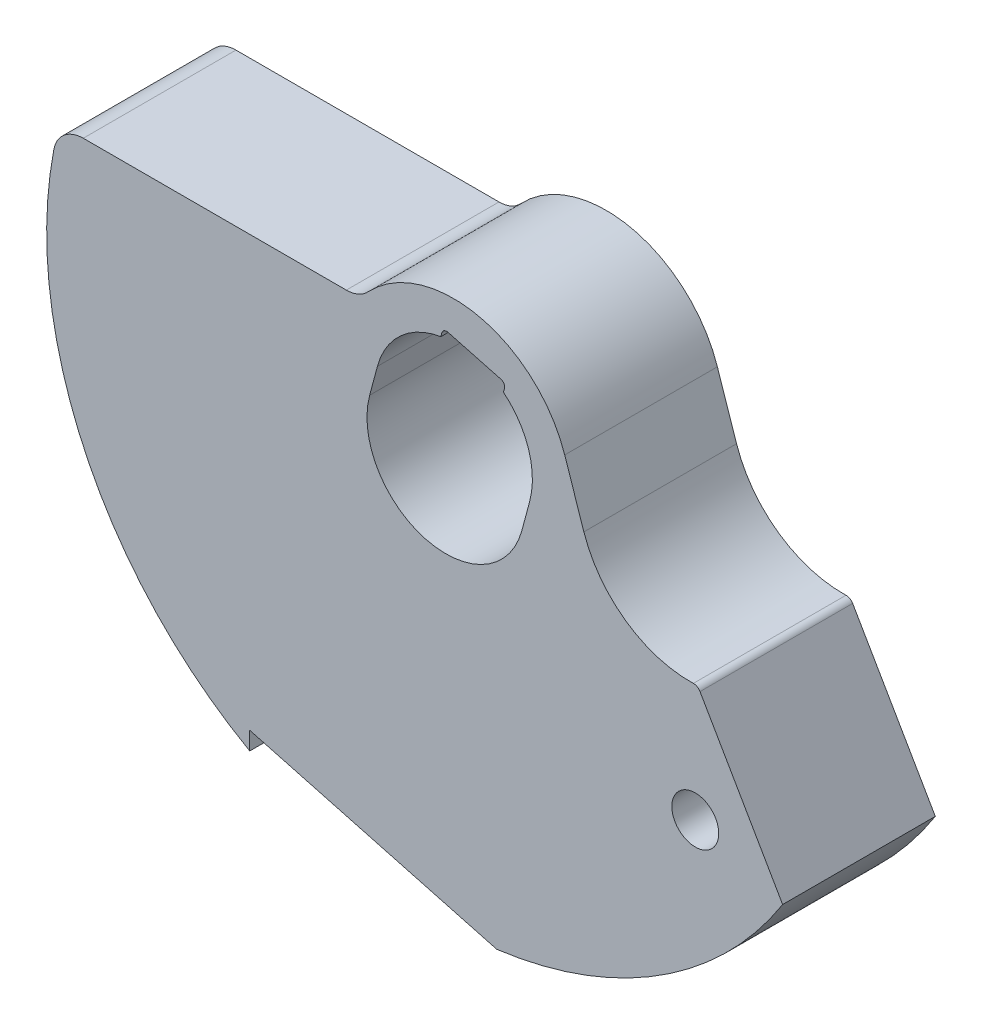
ISO-10303-21;
HEADER;
FILE_DESCRIPTION(('STEP AP214'),'2;1');
FILE_NAME('part.step','',(''),(''),'','','');
FILE_SCHEMA(('AUTOMOTIVE_DESIGN { 1 0 10303 214 1 1 1 1 }'));
ENDSEC;
DATA;
#1=APPLICATION_CONTEXT('core data for automotive mechanical design processes');
#2=APPLICATION_PROTOCOL_DEFINITION('international standard','automotive_design',2000,#1);
#3=PRODUCT_CONTEXT('',#1,'mechanical');
#4=PRODUCT('Part','Part','',(#3));
#5=PRODUCT_RELATED_PRODUCT_CATEGORY('part','',(#4));
#6=PRODUCT_DEFINITION_FORMATION('','',#4);
#7=PRODUCT_DEFINITION_CONTEXT('part definition',#1,'design');
#8=PRODUCT_DEFINITION('design','',#6,#7);
#9=PRODUCT_DEFINITION_SHAPE('','',#8);
#10=(LENGTH_UNIT() NAMED_UNIT(*) SI_UNIT(.MILLI.,.METRE.));
#11=(NAMED_UNIT(*) PLANE_ANGLE_UNIT() SI_UNIT($,.RADIAN.));
#12=(NAMED_UNIT(*) SI_UNIT($,.STERADIAN.) SOLID_ANGLE_UNIT());
#13=UNCERTAINTY_MEASURE_WITH_UNIT(LENGTH_MEASURE(1.E-05),#10,'distance_accuracy_value','');
#14=(GEOMETRIC_REPRESENTATION_CONTEXT(3) GLOBAL_UNCERTAINTY_ASSIGNED_CONTEXT((#13)) GLOBAL_UNIT_ASSIGNED_CONTEXT((#10,
#11,#12)) REPRESENTATION_CONTEXT('',''));
#15=CARTESIAN_POINT('',(0.,0.,0.));
#16=DIRECTION('',(0.,0.,1.));
#17=DIRECTION('',(1.,0.,0.));
#18=AXIS2_PLACEMENT_3D('',#15,#16,#17);
#19=CARTESIAN_POINT('',(-1.59474353920326,0.427310243464251,-7.7724));
#20=DIRECTION('',(0.96592582628907,-0.258819045102514,0.));
#21=DIRECTION('',(0.258819045102514,0.96592582628907,0.));
#22=AXIS2_PLACEMENT_3D('',#19,#20,#21);
#23=PLANE('',#22);
#24=DIRECTION('',(0.258819045102514,0.96592582628907,0.));
#25=VECTOR('',#24,1.);
#26=CARTESIAN_POINT('',(-1.59474353920326,0.427310243464251,0.));
#27=LINE('',#26,#25);
#28=CARTESIAN_POINT('',(-0.253578298371034,5.43260706359561,0.));
#29=VERTEX_POINT('',#28);
#30=CARTESIAN_POINT('',(-0.201054745135242,5.62862763286563,0.));
#31=VERTEX_POINT('',#30);
#32=EDGE_CURVE('E276',#29,#31,#27,.T.);
#33=ORIENTED_EDGE('',*,*,#32,.F.);
#34=DIRECTION('',(0.,0.,1.));
#35=VECTOR('',#34,1.);
#36=CARTESIAN_POINT('',(-0.253578298371034,5.43260706359561,-7.7724));
#37=LINE('',#36,#35);
#38=CARTESIAN_POINT('',(-0.253578298371034,5.43260706359561,-7.7724));
#39=VERTEX_POINT('',#38);
#40=EDGE_CURVE('E11',#39,#29,#37,.T.);
#41=ORIENTED_EDGE('',*,*,#40,.F.);
#42=DIRECTION('',(0.258819045102514,0.96592582628907,0.));
#43=VECTOR('',#42,1.);
#44=CARTESIAN_POINT('',(-1.59474353920326,0.427310243464251,-7.7724));
#45=LINE('',#44,#43);
#46=CARTESIAN_POINT('',(-0.201054745135242,5.62862763286563,-7.7724));
#47=VERTEX_POINT('',#46);
#48=EDGE_CURVE('E486',#39,#47,#45,.T.);
#49=ORIENTED_EDGE('',*,*,#48,.T.);
#50=DIRECTION('',(0.,0.,1.));
#51=VECTOR('',#50,1.);
#52=CARTESIAN_POINT('',(-0.201054745135242,5.62862763286563,-7.7724));
#53=LINE('',#52,#51);
#54=EDGE_CURVE('E333',#47,#31,#53,.T.);
#55=ORIENTED_EDGE('',*,*,#54,.T.);
#56=EDGE_LOOP('',(#33,#41,#49,#55));
#57=FACE_BOUND('',#56,.T.);
#58=ADVANCED_FACE('F41',(#57),#23,.T.);
#59=CARTESIAN_POINT('',(0.394440224736231,1.47207095926454,-7.7724));
#60=DIRECTION('',(0.,0.,1.));
#61=DIRECTION('',(1.,0.,0.));
#62=AXIS2_PLACEMENT_3D('',#59,#60,#61);
#63=CYLINDRICAL_SURFACE('',#62,4.0132);
#64=CARTESIAN_POINT('',(0.394440224736231,1.47207095926454,0.));
#65=DIRECTION('',(0.,0.,1.));
#66=DIRECTION('',(1.,0.,0.));
#67=AXIS2_PLACEMENT_3D('',#64,#65,#66);
#68=CIRCLE('',#67,4.0132);
#69=CARTESIAN_POINT('',(-3.48201330132707,2.51076355106995,0.));
#70=VERTEX_POINT('',#69);
#71=EDGE_CURVE('E309',#29,#70,#68,.T.);
#72=ORIENTED_EDGE('',*,*,#71,.T.);
#73=DIRECTION('',(0.,0.,1.));
#74=VECTOR('',#73,1.);
#75=CARTESIAN_POINT('',(-3.48201330132707,2.51076355106995,-7.7724));
#76=LINE('',#75,#74);
#77=CARTESIAN_POINT('',(-3.48201330132707,2.51076355106995,-7.7724));
#78=VERTEX_POINT('',#77);
#79=EDGE_CURVE('E52',#78,#70,#76,.T.);
#80=ORIENTED_EDGE('',*,*,#79,.F.);
#81=CARTESIAN_POINT('',(0.394440224736231,1.47207095926454,-7.7724));
#82=DIRECTION('',(0.,0.,1.));
#83=DIRECTION('',(1.,0.,0.));
#84=AXIS2_PLACEMENT_3D('',#81,#82,#83);
#85=CIRCLE('',#84,4.0132);
#86=EDGE_CURVE('E220',#39,#78,#85,.T.);
#87=ORIENTED_EDGE('',*,*,#86,.F.);
#88=ORIENTED_EDGE('',*,*,#40,.T.);
#89=EDGE_LOOP('',(#72,#80,#87,#88));
#90=FACE_BOUND('',#89,.T.);
#91=ADVANCED_FACE('F396',(#90),#63,.F.);
#92=CARTESIAN_POINT('',(-3.8764535260633,1.03869259180541,-7.7724));
#93=DIRECTION('',(0.96592582628907,-0.258819045102514,0.));
#94=DIRECTION('',(0.258819045102514,0.96592582628907,0.));
#95=AXIS2_PLACEMENT_3D('',#92,#93,#94);
#96=PLANE('',#95);
#97=DIRECTION('',(0.258819045102514,0.96592582628907,0.));
#98=VECTOR('',#97,1.);
#99=CARTESIAN_POINT('',(-3.8764535260633,1.03869259180541,0.));
#100=LINE('',#99,#98);
#101=CARTESIAN_POINT('',(-3.8764535260633,1.03869259180541,0.));
#102=VERTEX_POINT('',#101);
#103=EDGE_CURVE('E202',#102,#70,#100,.T.);
#104=ORIENTED_EDGE('',*,*,#103,.F.);
#105=DIRECTION('',(0.,0.,1.));
#106=VECTOR('',#105,1.);
#107=CARTESIAN_POINT('',(-3.8764535260633,1.03869259180541,-7.7724));
#108=LINE('',#107,#106);
#109=CARTESIAN_POINT('',(-3.8764535260633,1.03869259180541,-7.7724));
#110=VERTEX_POINT('',#109);
#111=EDGE_CURVE('E196',#110,#102,#108,.T.);
#112=ORIENTED_EDGE('',*,*,#111,.F.);
#113=DIRECTION('',(0.258819045102514,0.96592582628907,0.));
#114=VECTOR('',#113,1.);
#115=CARTESIAN_POINT('',(-3.8764535260633,1.03869259180541,-7.7724));
#116=LINE('',#115,#114);
#117=EDGE_CURVE('E200',#110,#78,#116,.T.);
#118=ORIENTED_EDGE('',*,*,#117,.T.);
#119=ORIENTED_EDGE('',*,*,#79,.T.);
#120=EDGE_LOOP('',(#104,#112,#118,#119));
#121=FACE_BOUND('',#120,.T.);
#122=ADVANCED_FACE('F198',(#121),#96,.T.);
#123=CARTESIAN_POINT('',(0.,0.,-7.7724));
#124=DIRECTION('',(0.,0.,1.));
#125=DIRECTION('',(1.,0.,0.));
#126=AXIS2_PLACEMENT_3D('',#123,#124,#125);
#127=CYLINDRICAL_SURFACE('',#126,4.0132);
#128=CARTESIAN_POINT('',(0.,0.,0.));
#129=DIRECTION('',(0.,0.,1.));
#130=DIRECTION('',(1.,0.,0.));
#131=AXIS2_PLACEMENT_3D('',#128,#129,#130);
#132=CIRCLE('',#131,4.0132);
#133=CARTESIAN_POINT('',(3.8764535260633,-1.03869259180541,0.));
#134=VERTEX_POINT('',#133);
#135=EDGE_CURVE('E304',#102,#134,#132,.T.);
#136=ORIENTED_EDGE('',*,*,#135,.T.);
#137=DIRECTION('',(0.,0.,1.));
#138=VECTOR('',#137,1.);
#139=CARTESIAN_POINT('',(3.8764535260633,-1.03869259180541,-7.7724));
#140=LINE('',#139,#138);
#141=CARTESIAN_POINT('',(3.8764535260633,-1.03869259180541,-7.7724));
#142=VERTEX_POINT('',#141);
#143=EDGE_CURVE('E207',#142,#134,#140,.T.);
#144=ORIENTED_EDGE('',*,*,#143,.F.);
#145=CARTESIAN_POINT('',(0.,0.,-7.7724));
#146=DIRECTION('',(0.,0.,1.));
#147=DIRECTION('',(1.,0.,0.));
#148=AXIS2_PLACEMENT_3D('',#145,#146,#147);
#149=CIRCLE('',#148,4.0132);
#150=EDGE_CURVE('E210',#110,#142,#149,.T.);
#151=ORIENTED_EDGE('',*,*,#150,.F.);
#152=ORIENTED_EDGE('',*,*,#111,.T.);
#153=EDGE_LOOP('',(#136,#144,#151,#152));
#154=FACE_BOUND('',#153,.T.);
#155=ADVANCED_FACE('F211',(#154),#127,.F.);
#156=CARTESIAN_POINT('',(3.8764535260633,-1.03869259180541,-7.7724));
#157=DIRECTION('',(-0.96592582628907,0.258819045102514,0.));
#158=DIRECTION('',(-0.258819045102514,-0.96592582628907,0.));
#159=AXIS2_PLACEMENT_3D('',#156,#157,#158);
#160=PLANE('',#159);
#161=DIRECTION('',(-0.258819045102514,-0.96592582628907,0.));
#162=VECTOR('',#161,1.);
#163=CARTESIAN_POINT('',(3.8764535260633,-1.03869259180541,0.));
#164=LINE('',#163,#162);
#165=CARTESIAN_POINT('',(4.27089375079953,0.433378367459132,0.));
#166=VERTEX_POINT('',#165);
#167=EDGE_CURVE('E300',#166,#134,#164,.T.);
#168=ORIENTED_EDGE('',*,*,#167,.F.);
#169=DIRECTION('',(0.,0.,1.));
#170=VECTOR('',#169,1.);
#171=CARTESIAN_POINT('',(4.27089375079953,0.433378367459132,-7.7724));
#172=LINE('',#171,#170);
#173=CARTESIAN_POINT('',(4.27089375079953,0.433378367459132,-7.7724));
#174=VERTEX_POINT('',#173);
#175=EDGE_CURVE('E317',#174,#166,#172,.T.);
#176=ORIENTED_EDGE('',*,*,#175,.F.);
#177=DIRECTION('',(-0.258819045102514,-0.96592582628907,0.));
#178=VECTOR('',#177,1.);
#179=CARTESIAN_POINT('',(3.8764535260633,-1.03869259180541,-7.7724));
#180=LINE('',#179,#178);
#181=EDGE_CURVE('E216',#174,#142,#180,.T.);
#182=ORIENTED_EDGE('',*,*,#181,.T.);
#183=ORIENTED_EDGE('',*,*,#143,.T.);
#184=EDGE_LOOP('',(#168,#176,#182,#183));
#185=FACE_BOUND('',#184,.T.);
#186=ADVANCED_FACE('F513',(#185),#160,.T.);
#187=CARTESIAN_POINT('',(0.394440224736231,1.47207095926454,-7.7724));
#188=DIRECTION('',(0.,0.,1.));
#189=DIRECTION('',(1.,0.,0.));
#190=AXIS2_PLACEMENT_3D('',#187,#188,#189);
#191=CYLINDRICAL_SURFACE('',#190,4.0132);
#192=CARTESIAN_POINT('',(0.394440224736231,1.47207095926454,0.));
#193=DIRECTION('',(0.,0.,1.));
#194=DIRECTION('',(1.,0.,0.));
#195=AXIS2_PLACEMENT_3D('',#192,#193,#194);
#196=CIRCLE('',#195,4.0132);
#197=CARTESIAN_POINT('',(2.93590878003548,4.5779865766671,0.));
#198=VERTEX_POINT('',#197);
#199=EDGE_CURVE('E296',#166,#198,#196,.T.);
#200=ORIENTED_EDGE('',*,*,#199,.T.);
#201=DIRECTION('',(0.,0.,1.));
#202=VECTOR('',#201,1.);
#203=CARTESIAN_POINT('',(2.93590878003548,4.5779865766671,-7.7724));
#204=LINE('',#203,#202);
#205=CARTESIAN_POINT('',(2.93590878003548,4.5779865766671,-7.7724));
#206=VERTEX_POINT('',#205);
#207=EDGE_CURVE('E320',#206,#198,#204,.T.);
#208=ORIENTED_EDGE('',*,*,#207,.F.);
#209=CARTESIAN_POINT('',(0.394440224736231,1.47207095926454,-7.7724));
#210=DIRECTION('',(0.,0.,1.));
#211=DIRECTION('',(1.,0.,0.));
#212=AXIS2_PLACEMENT_3D('',#209,#210,#211);
#213=CIRCLE('',#212,4.0132);
#214=EDGE_CURVE('E507',#174,#206,#213,.T.);
#215=ORIENTED_EDGE('',*,*,#214,.F.);
#216=ORIENTED_EDGE('',*,*,#175,.T.);
#217=EDGE_LOOP('',(#200,#208,#215,#216));
#218=FACE_BOUND('',#217,.T.);
#219=ADVANCED_FACE('F519',(#218),#191,.F.);
#220=CARTESIAN_POINT('',(1.59474353920326,-0.427310243464251,-7.7724));
#221=DIRECTION('',(0.96592582628907,-0.258819045102513,0.));
#222=DIRECTION('',(0.258819045102513,0.96592582628907,0.));
#223=AXIS2_PLACEMENT_3D('',#220,#221,#222);
#224=PLANE('',#223);
#225=DIRECTION('',(0.258819045102513,0.96592582628907,0.));
#226=VECTOR('',#225,1.);
#227=CARTESIAN_POINT('',(1.59474353920326,-0.427310243464251,0.));
#228=LINE('',#227,#226);
#229=CARTESIAN_POINT('',(2.98843233327127,4.77400714593713,0.));
#230=VERTEX_POINT('',#229);
#231=EDGE_CURVE('E292',#198,#230,#228,.T.);
#232=ORIENTED_EDGE('',*,*,#231,.T.);
#233=DIRECTION('',(0.,0.,1.));
#234=VECTOR('',#233,1.);
#235=CARTESIAN_POINT('',(2.98843233327127,4.77400714593713,-7.7724));
#236=LINE('',#235,#234);
#237=CARTESIAN_POINT('',(2.98843233327127,4.77400714593713,-7.7724));
#238=VERTEX_POINT('',#237);
#239=EDGE_CURVE('E324',#238,#230,#236,.T.);
#240=ORIENTED_EDGE('',*,*,#239,.F.);
#241=DIRECTION('',(0.258819045102513,0.96592582628907,0.));
#242=VECTOR('',#241,1.);
#243=CARTESIAN_POINT('',(1.59474353920326,-0.427310243464251,-7.7724));
#244=LINE('',#243,#242);
#245=EDGE_CURVE('E504',#206,#238,#244,.T.);
#246=ORIENTED_EDGE('',*,*,#245,.F.);
#247=ORIENTED_EDGE('',*,*,#207,.T.);
#248=EDGE_LOOP('',(#232,#240,#246,#247));
#249=FACE_BOUND('',#248,.T.);
#250=ADVANCED_FACE('F522',(#249),#224,.F.);
#251=CARTESIAN_POINT('',(2.74308717339385,4.83974718339317,-7.7724));
#252=DIRECTION('',(0.,0.,1.));
#253=DIRECTION('',(1.,0.,0.));
#254=AXIS2_PLACEMENT_3D('',#251,#252,#253);
#255=CYLINDRICAL_SURFACE('',#254,0.254);
#256=CARTESIAN_POINT('',(2.74308717339385,4.83974718339317,0.));
#257=DIRECTION('',(0.,0.,1.));
#258=DIRECTION('',(1.,0.,0.));
#259=AXIS2_PLACEMENT_3D('',#256,#257,#258);
#260=CIRCLE('',#259,0.254);
#261=CARTESIAN_POINT('',(2.80882721084989,5.0850923432706,0.));
#262=VERTEX_POINT('',#261);
#263=EDGE_CURVE('E288',#262,#230,#260,.F.);
#264=ORIENTED_EDGE('',*,*,#263,.F.);
#265=DIRECTION('',(0.,0.,1.));
#266=VECTOR('',#265,1.);
#267=CARTESIAN_POINT('',(2.80882721084989,5.0850923432706,-7.7724));
#268=LINE('',#267,#266);
#269=CARTESIAN_POINT('',(2.80882721084989,5.0850923432706,-7.7724));
#270=VERTEX_POINT('',#269);
#271=EDGE_CURVE('E327',#270,#262,#268,.T.);
#272=ORIENTED_EDGE('',*,*,#271,.F.);
#273=CARTESIAN_POINT('',(2.74308717339385,4.83974718339317,-7.7724));
#274=DIRECTION('',(0.,0.,1.));
#275=DIRECTION('',(1.,0.,0.));
#276=AXIS2_PLACEMENT_3D('',#273,#274,#275);
#277=CIRCLE('',#276,0.254);
#278=EDGE_CURVE('E500',#270,#238,#277,.F.);
#279=ORIENTED_EDGE('',*,*,#278,.T.);
#280=ORIENTED_EDGE('',*,*,#239,.T.);
#281=EDGE_LOOP('',(#264,#272,#279,#280));
#282=FACE_BOUND('',#281,.T.);
#283=ADVANCED_FACE('F525',(#282),#255,.F.);
#284=CARTESIAN_POINT('',(1.45942883152406,5.44666254927881,-7.7724));
#285=DIRECTION('',(0.258819045102514,0.96592582628907,0.));
#286=DIRECTION('',(-0.96592582628907,0.258819045102514,0.));
#287=AXIS2_PLACEMENT_3D('',#284,#285,#286);
#288=PLANE('',#287);
#289=DIRECTION('',(-0.96592582628907,0.258819045102514,0.));
#290=VECTOR('',#289,1.);
#291=CARTESIAN_POINT('',(1.45942883152406,5.44666254927881,0.));
#292=LINE('',#291,#290);
#293=CARTESIAN_POINT('',(0.110030452198222,5.80823275528702,0.));
#294=VERTEX_POINT('',#293);
#295=EDGE_CURVE('E284',#262,#294,#292,.T.);
#296=ORIENTED_EDGE('',*,*,#295,.T.);
#297=DIRECTION('',(0.,0.,1.));
#298=VECTOR('',#297,1.);
#299=CARTESIAN_POINT('',(0.110030452198222,5.80823275528702,-7.7724));
#300=LINE('',#299,#298);
#301=CARTESIAN_POINT('',(0.110030452198222,5.80823275528702,-7.7724));
#302=VERTEX_POINT('',#301);
#303=EDGE_CURVE('E330',#302,#294,#300,.T.);
#304=ORIENTED_EDGE('',*,*,#303,.F.);
#305=DIRECTION('',(-0.96592582628907,0.258819045102514,0.));
#306=VECTOR('',#305,1.);
#307=CARTESIAN_POINT('',(1.45942883152406,5.44666254927881,-7.7724));
#308=LINE('',#307,#306);
#309=EDGE_CURVE('E497',#270,#302,#308,.T.);
#310=ORIENTED_EDGE('',*,*,#309,.F.);
#311=ORIENTED_EDGE('',*,*,#271,.T.);
#312=EDGE_LOOP('',(#296,#304,#310,#311));
#313=FACE_BOUND('',#312,.T.);
#314=ADVANCED_FACE('F530',(#313),#288,.F.);
#315=CARTESIAN_POINT('',(-5.06526245222852,6.60399999999999,-7.7724));
#316=DIRECTION('',(0.,0.,1.));
#317=DIRECTION('',(1.,0.,0.));
#318=AXIS2_PLACEMENT_3D('',#315,#316,#317);
#319=CYLINDRICAL_SURFACE('',#318,1.524);
#320=CARTESIAN_POINT('',(-5.06526245222852,6.60399999999999,0.));
#321=DIRECTION('',(0.,0.,1.));
#322=DIRECTION('',(1.,0.,0.));
#323=AXIS2_PLACEMENT_3D('',#320,#321,#322);
#324=CIRCLE('',#323,1.524);
#325=CARTESIAN_POINT('',(-5.06526245222852,5.07999999999999,0.));
#326=VERTEX_POINT('',#325);
#327=CARTESIAN_POINT('',(-3.954814450134,5.56021782222329,0.));
#328=VERTEX_POINT('',#327);
#329=EDGE_CURVE('E227',#326,#328,#324,.T.);
#330=ORIENTED_EDGE('',*,*,#329,.T.);
#331=DIRECTION('',(0.,0.,1.));
#332=VECTOR('',#331,1.);
#333=CARTESIAN_POINT('',(-3.954814450134,5.56021782222329,-7.7724));
#334=LINE('',#333,#332);
#335=CARTESIAN_POINT('',(-3.954814450134,5.56021782222329,-7.7724));
#336=VERTEX_POINT('',#335);
#337=EDGE_CURVE('E336',#336,#328,#334,.T.);
#338=ORIENTED_EDGE('',*,*,#337,.F.);
#339=CARTESIAN_POINT('',(-5.06526245222852,6.60399999999999,-7.7724));
#340=DIRECTION('',(0.,0.,1.));
#341=DIRECTION('',(1.,0.,0.));
#342=AXIS2_PLACEMENT_3D('',#339,#340,#341);
#343=CIRCLE('',#342,1.524);
#344=CARTESIAN_POINT('',(-5.06526245222852,5.07999999999999,-7.7724));
#345=VERTEX_POINT('',#344);
#346=EDGE_CURVE('E311',#345,#336,#343,.T.);
#347=ORIENTED_EDGE('',*,*,#346,.F.);
#348=DIRECTION('',(0.,0.,1.));
#349=VECTOR('',#348,1.);
#350=CARTESIAN_POINT('',(-5.06526245222852,5.07999999999999,-7.7724));
#351=LINE('',#350,#349);
#352=EDGE_CURVE('E45',#345,#326,#351,.T.);
#353=ORIENTED_EDGE('',*,*,#352,.T.);
#354=EDGE_LOOP('',(#330,#338,#347,#353));
#355=FACE_BOUND('',#354,.T.);
#356=ADVANCED_FACE('F43',(#355),#319,.F.);
#357=CARTESIAN_POINT('',(0.394440224736231,1.47207095926454,-7.7724));
#358=DIRECTION('',(0.,0.,1.));
#359=DIRECTION('',(1.,0.,0.));
#360=AXIS2_PLACEMENT_3D('',#357,#358,#359);
#361=CYLINDRICAL_SURFACE('',#360,5.969);
#362=CARTESIAN_POINT('',(0.394440224736231,1.47207095926454,0.));
#363=DIRECTION('',(0.,0.,1.));
#364=DIRECTION('',(1.,0.,0.));
#365=AXIS2_PLACEMENT_3D('',#362,#363,#364);
#366=CIRCLE('',#365,5.969);
#367=CARTESIAN_POINT('',(6.05309678714434,3.37169379254373,0.));
#368=VERTEX_POINT('',#367);
#369=EDGE_CURVE('E268',#368,#328,#366,.T.);
#370=ORIENTED_EDGE('',*,*,#369,.F.);
#371=DIRECTION('',(0.,0.,1.));
#372=VECTOR('',#371,1.);
#373=CARTESIAN_POINT('',(6.05309678714434,3.37169379254373,-7.7724));
#374=LINE('',#373,#372);
#375=CARTESIAN_POINT('',(6.05309678714434,3.37169379254373,-7.7724));
#376=VERTEX_POINT('',#375);
#377=EDGE_CURVE('E339',#376,#368,#374,.T.);
#378=ORIENTED_EDGE('',*,*,#377,.F.);
#379=CARTESIAN_POINT('',(0.394440224736231,1.47207095926454,-7.7724));
#380=DIRECTION('',(0.,0.,1.));
#381=DIRECTION('',(1.,0.,0.));
#382=AXIS2_PLACEMENT_3D('',#379,#380,#381);
#383=CIRCLE('',#382,5.969);
#384=EDGE_CURVE('E478',#376,#336,#383,.T.);
#385=ORIENTED_EDGE('',*,*,#384,.T.);
#386=ORIENTED_EDGE('',*,*,#337,.T.);
#387=EDGE_LOOP('',(#370,#378,#385,#386));
#388=FACE_BOUND('',#387,.T.);
#389=ADVANCED_FACE('F404',(#388),#361,.T.);
#390=CARTESIAN_POINT('',(6.45727326224385,2.16772012833758,-7.7724));
#391=DIRECTION('',(-0.948007465640494,-0.318248087331075,0.));
#392=DIRECTION('',(0.318248087331075,-0.948007465640494,0.));
#393=AXIS2_PLACEMENT_3D('',#390,#391,#392);
#394=PLANE('',#393);
#395=DIRECTION('',(0.318248087331075,-0.948007465640494,0.));
#396=VECTOR('',#395,1.);
#397=CARTESIAN_POINT('',(6.45727326224385,2.16772012833758,0.));
#398=LINE('',#397,#396);
#399=CARTESIAN_POINT('',(7.02813733386458,0.467212180902899,0.));
#400=VERTEX_POINT('',#399);
#401=EDGE_CURVE('E265',#368,#400,#398,.T.);
#402=ORIENTED_EDGE('',*,*,#401,.T.);
#403=DIRECTION('',(0.,0.,1.));
#404=VECTOR('',#403,1.);
#405=CARTESIAN_POINT('',(7.02813733386458,0.467212180902899,-7.7724));
#406=LINE('',#405,#404);
#407=CARTESIAN_POINT('',(7.02813733386458,0.467212180902899,-7.7724));
#408=VERTEX_POINT('',#407);
#409=EDGE_CURVE('E342',#408,#400,#406,.T.);
#410=ORIENTED_EDGE('',*,*,#409,.F.);
#411=DIRECTION('',(0.318248087331075,-0.948007465640494,0.));
#412=VECTOR('',#411,1.);
#413=CARTESIAN_POINT('',(6.45727326224385,2.16772012833758,-7.7724));
#414=LINE('',#413,#412);
#415=EDGE_CURVE('E475',#376,#408,#414,.T.);
#416=ORIENTED_EDGE('',*,*,#415,.F.);
#417=ORIENTED_EDGE('',*,*,#377,.T.);
#418=EDGE_LOOP('',(#402,#410,#416,#417));
#419=FACE_BOUND('',#418,.T.);
#420=ADVANCED_FACE('F407',(#419),#394,.F.);
#421=CARTESIAN_POINT('',(12.446,2.286,-7.7724));
#422=DIRECTION('',(0.,0.,1.));
#423=DIRECTION('',(1.,0.,0.));
#424=AXIS2_PLACEMENT_3D('',#421,#422,#423);
#425=CYLINDRICAL_SURFACE('',#424,5.715);
#426=CARTESIAN_POINT('',(12.446,2.286,0.));
#427=DIRECTION('',(0.,0.,1.));
#428=DIRECTION('',(1.,0.,0.));
#429=AXIS2_PLACEMENT_3D('',#426,#427,#428);
#430=CIRCLE('',#429,5.715);
#431=CARTESIAN_POINT('',(12.6000873097443,-3.42692237834331,0.));
#432=VERTEX_POINT('',#431);
#433=EDGE_CURVE('E262',#400,#432,#430,.T.);
#434=ORIENTED_EDGE('',*,*,#433,.T.);
#435=DIRECTION('',(0.,0.,1.));
#436=VECTOR('',#435,1.);
#437=CARTESIAN_POINT('',(12.6000873097443,-3.42692237834331,-7.7724));
#438=LINE('',#437,#436);
#439=CARTESIAN_POINT('',(12.6000873097443,-3.42692237834331,-7.7724));
#440=VERTEX_POINT('',#439);
#441=EDGE_CURVE('E346',#440,#432,#438,.T.);
#442=ORIENTED_EDGE('',*,*,#441,.F.);
#443=CARTESIAN_POINT('',(12.446,2.286,-7.7724));
#444=DIRECTION('',(0.,0.,1.));
#445=DIRECTION('',(1.,0.,0.));
#446=AXIS2_PLACEMENT_3D('',#443,#444,#445);
#447=CIRCLE('',#446,5.715);
#448=EDGE_CURVE('E473',#408,#440,#447,.T.);
#449=ORIENTED_EDGE('',*,*,#448,.F.);
#450=ORIENTED_EDGE('',*,*,#409,.T.);
#451=EDGE_LOOP('',(#434,#442,#449,#450));
#452=FACE_BOUND('',#451,.T.);
#453=ADVANCED_FACE('F411',(#452),#425,.F.);
#454=CARTESIAN_POINT('',(12.6103597970606,-3.80778387023287,-7.7724));
#455=DIRECTION('',(0.,0.,1.));
#456=DIRECTION('',(1.,0.,0.));
#457=AXIS2_PLACEMENT_3D('',#454,#455,#456);
#458=CYLINDRICAL_SURFACE('',#457,0.381);
#459=CARTESIAN_POINT('',(12.6103597970606,-3.80778387023287,0.));
#460=DIRECTION('',(0.,0.,1.));
#461=DIRECTION('',(1.,0.,0.));
#462=AXIS2_PLACEMENT_3D('',#459,#460,#461);
#463=CIRCLE('',#462,0.381);
#464=CARTESIAN_POINT('',(12.9403154759025,-3.61728387023286,0.));
#465=VERTEX_POINT('',#464);
#466=EDGE_CURVE('E259',#432,#465,#463,.F.);
#467=ORIENTED_EDGE('',*,*,#466,.T.);
#468=DIRECTION('',(0.,0.,1.));
#469=VECTOR('',#468,1.);
#470=CARTESIAN_POINT('',(12.9403154759025,-3.61728387023286,-7.7724));
#471=LINE('',#470,#469);
#472=CARTESIAN_POINT('',(12.9403154759025,-3.61728387023286,-7.7724));
#473=VERTEX_POINT('',#472);
#474=EDGE_CURVE('E350',#473,#465,#471,.T.);
#475=ORIENTED_EDGE('',*,*,#474,.F.);
#476=CARTESIAN_POINT('',(12.6103597970606,-3.80778387023287,-7.7724));
#477=DIRECTION('',(0.,0.,1.));
#478=DIRECTION('',(1.,0.,0.));
#479=AXIS2_PLACEMENT_3D('',#476,#477,#478);
#480=CIRCLE('',#479,0.381);
#481=EDGE_CURVE('E468',#440,#473,#480,.F.);
#482=ORIENTED_EDGE('',*,*,#481,.F.);
#483=ORIENTED_EDGE('',*,*,#441,.T.);
#484=EDGE_LOOP('',(#467,#475,#482,#483));
#485=FACE_BOUND('',#484,.T.);
#486=ADVANCED_FACE('F415',(#485),#458,.T.);
#487=CARTESIAN_POINT('',(8.13890674476613,4.69900000000004,-7.7724));
#488=DIRECTION('',(-0.866025403784436,-0.500000000000004,0.));
#489=DIRECTION('',(0.500000000000004,-0.866025403784436,0.));
#490=AXIS2_PLACEMENT_3D('',#487,#488,#489);
#491=PLANE('',#490);
#492=DIRECTION('',(0.500000000000004,-0.866025403784436,0.));
#493=VECTOR('',#492,1.);
#494=CARTESIAN_POINT('',(8.13890674476613,4.69900000000004,0.));
#495=LINE('',#494,#493);
#496=CARTESIAN_POINT('',(17.1469586429293,-10.9034035648357,0.));
#497=VERTEX_POINT('',#496);
#498=EDGE_CURVE('E255',#465,#497,#495,.T.);
#499=ORIENTED_EDGE('',*,*,#498,.T.);
#500=DIRECTION('',(0.,0.,1.));
#501=VECTOR('',#500,1.);
#502=CARTESIAN_POINT('',(17.1469586429293,-10.9034035648357,-7.7724));
#503=LINE('',#502,#501);
#504=CARTESIAN_POINT('',(17.1469586429293,-10.9034035648357,-7.7724));
#505=VERTEX_POINT('',#504);
#506=EDGE_CURVE('E354',#505,#497,#503,.T.);
#507=ORIENTED_EDGE('',*,*,#506,.F.);
#508=DIRECTION('',(0.500000000000004,-0.866025403784436,0.));
#509=VECTOR('',#508,1.);
#510=CARTESIAN_POINT('',(8.13890674476613,4.69900000000004,-7.7724));
#511=LINE('',#510,#509);
#512=EDGE_CURVE('E466',#473,#505,#511,.T.);
#513=ORIENTED_EDGE('',*,*,#512,.F.);
#514=ORIENTED_EDGE('',*,*,#474,.T.);
#515=EDGE_LOOP('',(#499,#507,#513,#514));
#516=FACE_BOUND('',#515,.T.);
#517=ADVANCED_FACE('F419',(#516),#491,.F.);
#518=CARTESIAN_POINT('',(0.,0.,-7.7724));
#519=DIRECTION('',(0.,0.,1.));
#520=DIRECTION('',(1.,0.,0.));
#521=AXIS2_PLACEMENT_3D('',#518,#519,#520);
#522=CYLINDRICAL_SURFACE('',#521,20.32);
#523=CARTESIAN_POINT('',(0.,0.,0.));
#524=DIRECTION('',(0.,0.,1.));
#525=DIRECTION('',(1.,0.,0.));
#526=AXIS2_PLACEMENT_3D('',#523,#524,#525);
#527=CIRCLE('',#526,20.32);
#528=CARTESIAN_POINT('',(2.59308441542168,-20.1538659620058,0.));
#529=VERTEX_POINT('',#528);
#530=EDGE_CURVE('E251',#529,#497,#527,.T.);
#531=ORIENTED_EDGE('',*,*,#530,.F.);
#532=DIRECTION('',(0.,0.,1.));
#533=VECTOR('',#532,1.);
#534=CARTESIAN_POINT('',(2.59308441542168,-20.1538659620058,-7.7724));
#535=LINE('',#534,#533);
#536=CARTESIAN_POINT('',(2.59308441542168,-20.1538659620058,-7.7724));
#537=VERTEX_POINT('',#536);
#538=EDGE_CURVE('E357',#537,#529,#535,.T.);
#539=ORIENTED_EDGE('',*,*,#538,.F.);
#540=CARTESIAN_POINT('',(0.,0.,-7.7724));
#541=DIRECTION('',(0.,0.,1.));
#542=DIRECTION('',(1.,0.,0.));
#543=AXIS2_PLACEMENT_3D('',#540,#541,#542);
#544=CIRCLE('',#543,20.32);
#545=EDGE_CURVE('E463',#537,#505,#544,.T.);
#546=ORIENTED_EDGE('',*,*,#545,.T.);
#547=ORIENTED_EDGE('',*,*,#506,.T.);
#548=EDGE_LOOP('',(#531,#539,#546,#547));
#549=FACE_BOUND('',#548,.T.);
#550=ADVANCED_FACE('F423',(#549),#522,.T.);
#551=CARTESIAN_POINT('',(-4.86476277174686,-18.1555418309294,-7.7724));
#552=DIRECTION('',(-0.258819045102514,-0.96592582628907,0.));
#553=DIRECTION('',(0.96592582628907,-0.258819045102514,0.));
#554=AXIS2_PLACEMENT_3D('',#551,#552,#553);
#555=PLANE('',#554);
#556=DIRECTION('',(0.96592582628907,-0.258819045102514,0.));
#557=VECTOR('',#556,1.);
#558=CARTESIAN_POINT('',(-4.86476277174686,-18.1555418309294,0.));
#559=LINE('',#558,#557);
#560=CARTESIAN_POINT('',(-9.9822,-16.784328658302,0.));
#561=VERTEX_POINT('',#560);
#562=EDGE_CURVE('E247',#561,#529,#559,.T.);
#563=ORIENTED_EDGE('',*,*,#562,.F.);
#564=DIRECTION('',(0.,0.,1.));
#565=VECTOR('',#564,1.);
#566=CARTESIAN_POINT('',(-9.9822,-16.784328658302,-7.7724));
#567=LINE('',#566,#565);
#568=CARTESIAN_POINT('',(-9.9822,-16.784328658302,-7.7724));
#569=VERTEX_POINT('',#568);
#570=EDGE_CURVE('E360',#569,#561,#567,.T.);
#571=ORIENTED_EDGE('',*,*,#570,.F.);
#572=DIRECTION('',(0.96592582628907,-0.258819045102514,0.));
#573=VECTOR('',#572,1.);
#574=CARTESIAN_POINT('',(-4.86476277174686,-18.1555418309294,-7.7724));
#575=LINE('',#574,#573);
#576=EDGE_CURVE('E456',#569,#537,#575,.T.);
#577=ORIENTED_EDGE('',*,*,#576,.T.);
#578=ORIENTED_EDGE('',*,*,#538,.T.);
#579=EDGE_LOOP('',(#563,#571,#577,#578));
#580=FACE_BOUND('',#579,.T.);
#581=ADVANCED_FACE('F427',(#580),#555,.T.);
#582=CARTESIAN_POINT('',(-9.9822,0.,-7.7724));
#583=DIRECTION('',(-1.,0.,0.));
#584=DIRECTION('',(0.,0.,1.));
#585=AXIS2_PLACEMENT_3D('',#582,#583,#584);
#586=PLANE('',#585);
#587=DIRECTION('',(0.,-1.,0.));
#588=VECTOR('',#587,1.);
#589=CARTESIAN_POINT('',(-9.9822,0.,0.));
#590=LINE('',#589,#588);
#591=CARTESIAN_POINT('',(-9.9822,-17.699098371386,0.));
#592=VERTEX_POINT('',#591);
#593=EDGE_CURVE('E243',#561,#592,#590,.T.);
#594=ORIENTED_EDGE('',*,*,#593,.T.);
#595=DIRECTION('',(0.,0.,1.));
#596=VECTOR('',#595,1.);
#597=CARTESIAN_POINT('',(-9.9822,-17.699098371386,-7.7724));
#598=LINE('',#597,#596);
#599=CARTESIAN_POINT('',(-9.9822,-17.699098371386,-7.7724));
#600=VERTEX_POINT('',#599);
#601=EDGE_CURVE('E363',#600,#592,#598,.T.);
#602=ORIENTED_EDGE('',*,*,#601,.F.);
#603=DIRECTION('',(0.,-1.,0.));
#604=VECTOR('',#603,1.);
#605=CARTESIAN_POINT('',(-9.9822,0.,-7.7724));
#606=LINE('',#605,#604);
#607=EDGE_CURVE('E453',#569,#600,#606,.T.);
#608=ORIENTED_EDGE('',*,*,#607,.F.);
#609=ORIENTED_EDGE('',*,*,#570,.T.);
#610=EDGE_LOOP('',(#594,#602,#608,#609));
#611=FACE_BOUND('',#610,.T.);
#612=ADVANCED_FACE('F431',(#611),#586,.F.);
#613=CARTESIAN_POINT('',(0.,0.,-7.7724));
#614=DIRECTION('',(0.,0.,1.));
#615=DIRECTION('',(1.,0.,0.));
#616=AXIS2_PLACEMENT_3D('',#613,#614,#615);
#617=CYLINDRICAL_SURFACE('',#616,20.32);
#618=CARTESIAN_POINT('',(0.,0.,0.));
#619=DIRECTION('',(0.,0.,1.));
#620=DIRECTION('',(1.,0.,0.));
#621=AXIS2_PLACEMENT_3D('',#618,#619,#620);
#622=CIRCLE('',#621,20.32);
#623=CARTESIAN_POINT('',(-19.953034117382,3.84432432432431,0.));
#624=VERTEX_POINT('',#623);
#625=EDGE_CURVE('E239',#624,#592,#622,.T.);
#626=ORIENTED_EDGE('',*,*,#625,.F.);
#627=DIRECTION('',(0.,0.,1.));
#628=VECTOR('',#627,1.);
#629=CARTESIAN_POINT('',(-19.953034117382,3.84432432432431,-7.7724));
#630=LINE('',#629,#628);
#631=CARTESIAN_POINT('',(-19.953034117382,3.84432432432431,-7.7724));
#632=VERTEX_POINT('',#631);
#633=EDGE_CURVE('E366',#632,#624,#630,.T.);
#634=ORIENTED_EDGE('',*,*,#633,.F.);
#635=CARTESIAN_POINT('',(0.,0.,-7.7724));
#636=DIRECTION('',(0.,0.,1.));
#637=DIRECTION('',(1.,0.,0.));
#638=AXIS2_PLACEMENT_3D('',#635,#636,#637);
#639=CIRCLE('',#638,20.32);
#640=EDGE_CURVE('E451',#632,#600,#639,.T.);
#641=ORIENTED_EDGE('',*,*,#640,.T.);
#642=ORIENTED_EDGE('',*,*,#601,.T.);
#643=EDGE_LOOP('',(#626,#634,#641,#642));
#644=FACE_BOUND('',#643,.T.);
#645=ADVANCED_FACE('F435',(#644),#617,.T.);
#646=CARTESIAN_POINT('',(-18.4565565585783,3.55599999999999,-7.7724));
#647=DIRECTION('',(0.,0.,1.));
#648=DIRECTION('',(1.,0.,0.));
#649=AXIS2_PLACEMENT_3D('',#646,#647,#648);
#650=CYLINDRICAL_SURFACE('',#649,1.524);
#651=CARTESIAN_POINT('',(-18.4565565585783,3.55599999999999,0.));
#652=DIRECTION('',(0.,0.,1.));
#653=DIRECTION('',(1.,0.,0.));
#654=AXIS2_PLACEMENT_3D('',#651,#652,#653);
#655=CIRCLE('',#654,1.524);
#656=CARTESIAN_POINT('',(-18.4565565585783,5.07999999999999,0.));
#657=VERTEX_POINT('',#656);
#658=EDGE_CURVE('E235',#657,#624,#655,.T.);
#659=ORIENTED_EDGE('',*,*,#658,.F.);
#660=DIRECTION('',(0.,0.,1.));
#661=VECTOR('',#660,1.);
#662=CARTESIAN_POINT('',(-18.4565565585783,5.07999999999999,-7.7724));
#663=LINE('',#662,#661);
#664=CARTESIAN_POINT('',(-18.4565565585783,5.07999999999999,-7.7724));
#665=VERTEX_POINT('',#664);
#666=EDGE_CURVE('E368',#665,#657,#663,.T.);
#667=ORIENTED_EDGE('',*,*,#666,.F.);
#668=CARTESIAN_POINT('',(-18.4565565585783,3.55599999999999,-7.7724));
#669=DIRECTION('',(0.,0.,1.));
#670=DIRECTION('',(1.,0.,0.));
#671=AXIS2_PLACEMENT_3D('',#668,#669,#670);
#672=CIRCLE('',#671,1.524);
#673=EDGE_CURVE('E704',#665,#632,#672,.T.);
#674=ORIENTED_EDGE('',*,*,#673,.T.);
#675=ORIENTED_EDGE('',*,*,#633,.T.);
#676=EDGE_LOOP('',(#659,#667,#674,#675));
#677=FACE_BOUND('',#676,.T.);
#678=ADVANCED_FACE('F391',(#677),#650,.T.);
#679=CARTESIAN_POINT('',(12.7,-9.39800000000001,-7.7724));
#680=DIRECTION('',(0.,0.,1.));
#681=DIRECTION('',(1.,0.,0.));
#682=AXIS2_PLACEMENT_3D('',#679,#680,#681);
#683=CYLINDRICAL_SURFACE('',#682,1.1938);
#684=CARTESIAN_POINT('',(12.7,-9.39800000000001,-7.7724));
#685=DIRECTION('',(0.,0.,1.));
#686=DIRECTION('',(1.,0.,0.));
#687=AXIS2_PLACEMENT_3D('',#684,#685,#686);
#688=CIRCLE('',#687,1.1938);
#689=CARTESIAN_POINT('',(13.8938,-9.39800000000001,-7.7724));
#690=VERTEX_POINT('',#689);
#691=EDGE_CURVE('E481',#690,#690,#688,.T.);
#692=ORIENTED_EDGE('',*,*,#691,.F.);
#693=EDGE_LOOP('',(#692));
#694=FACE_BOUND('',#693,.T.);
#695=CARTESIAN_POINT('',(12.7,-9.39800000000001,0.));
#696=DIRECTION('',(0.,0.,1.));
#697=DIRECTION('',(1.,0.,0.));
#698=AXIS2_PLACEMENT_3D('',#695,#696,#697);
#699=CIRCLE('',#698,1.1938);
#700=CARTESIAN_POINT('',(13.8938,-9.39800000000001,0.));
#701=VERTEX_POINT('',#700);
#702=EDGE_CURVE('E272',#701,#701,#699,.T.);
#703=ORIENTED_EDGE('',*,*,#702,.T.);
#704=EDGE_LOOP('',(#703));
#705=FACE_BOUND('',#704,.T.);
#706=ADVANCED_FACE('F384',(#694,#705),#683,.F.);
#707=CARTESIAN_POINT('',(0.,5.07999999999999,-7.7724));
#708=DIRECTION('',(0.,1.,0.));
#709=DIRECTION('',(-1.,0.,0.));
#710=AXIS2_PLACEMENT_3D('',#707,#708,#709);
#711=PLANE('',#710);
#712=DIRECTION('',(-1.,0.,0.));
#713=VECTOR('',#712,1.);
#714=CARTESIAN_POINT('',(0.,5.07999999999999,0.));
#715=LINE('',#714,#713);
#716=EDGE_CURVE('E231',#326,#657,#715,.T.);
#717=ORIENTED_EDGE('',*,*,#716,.F.);
#718=ORIENTED_EDGE('',*,*,#352,.F.);
#719=DIRECTION('',(-1.,0.,0.));
#720=VECTOR('',#719,1.);
#721=CARTESIAN_POINT('',(0.,5.07999999999999,-7.7724));
#722=LINE('',#721,#720);
#723=EDGE_CURVE('E700',#345,#665,#722,.T.);
#724=ORIENTED_EDGE('',*,*,#723,.T.);
#725=ORIENTED_EDGE('',*,*,#666,.T.);
#726=EDGE_LOOP('',(#717,#718,#724,#725));
#727=FACE_BOUND('',#726,.T.);
#728=ADVANCED_FACE('F381',(#727),#711,.T.);
#729=CARTESIAN_POINT('',(0.044290414742182,5.5628875954096,-7.7724));
#730=DIRECTION('',(0.,0.,1.));
#731=DIRECTION('',(1.,0.,0.));
#732=AXIS2_PLACEMENT_3D('',#729,#730,#731);
#733=CYLINDRICAL_SURFACE('',#732,0.254);
#734=CARTESIAN_POINT('',(0.044290414742182,5.5628875954096,0.));
#735=DIRECTION('',(0.,0.,1.));
#736=DIRECTION('',(1.,0.,0.));
#737=AXIS2_PLACEMENT_3D('',#734,#735,#736);
#738=CIRCLE('',#737,0.254);
#739=EDGE_CURVE('E280',#31,#294,#738,.F.);
#740=ORIENTED_EDGE('',*,*,#739,.F.);
#741=ORIENTED_EDGE('',*,*,#54,.F.);
#742=CARTESIAN_POINT('',(0.044290414742182,5.5628875954096,-7.7724));
#743=DIRECTION('',(0.,0.,1.));
#744=DIRECTION('',(1.,0.,0.));
#745=AXIS2_PLACEMENT_3D('',#742,#743,#744);
#746=CIRCLE('',#745,0.254);
#747=EDGE_CURVE('E493',#47,#302,#746,.F.);
#748=ORIENTED_EDGE('',*,*,#747,.T.);
#749=ORIENTED_EDGE('',*,*,#303,.T.);
#750=EDGE_LOOP('',(#740,#741,#748,#749));
#751=FACE_BOUND('',#750,.T.);
#752=ADVANCED_FACE('F383',(#751),#733,.F.);
#753=CARTESIAN_POINT('',(0.,0.,-7.7724));
#754=DIRECTION('',(0.,0.,1.));
#755=DIRECTION('',(1.,0.,0.));
#756=AXIS2_PLACEMENT_3D('',#753,#754,#755);
#757=PLANE('',#756);
#758=ORIENTED_EDGE('',*,*,#346,.T.);
#759=ORIENTED_EDGE('',*,*,#384,.F.);
#760=ORIENTED_EDGE('',*,*,#415,.T.);
#761=ORIENTED_EDGE('',*,*,#448,.T.);
#762=ORIENTED_EDGE('',*,*,#481,.T.);
#763=ORIENTED_EDGE('',*,*,#512,.T.);
#764=ORIENTED_EDGE('',*,*,#545,.F.);
#765=ORIENTED_EDGE('',*,*,#576,.F.);
#766=ORIENTED_EDGE('',*,*,#607,.T.);
#767=ORIENTED_EDGE('',*,*,#640,.F.);
#768=ORIENTED_EDGE('',*,*,#673,.F.);
#769=ORIENTED_EDGE('',*,*,#723,.F.);
#770=EDGE_LOOP('',(#758,#759,#760,#761,#762,#763,#764,#765,#766,#767,#768,#769));
#771=FACE_BOUND('',#770,.T.);
#772=ORIENTED_EDGE('',*,*,#691,.T.);
#773=EDGE_LOOP('',(#772));
#774=FACE_BOUND('',#773,.T.);
#775=ORIENTED_EDGE('',*,*,#48,.F.);
#776=ORIENTED_EDGE('',*,*,#86,.T.);
#777=ORIENTED_EDGE('',*,*,#117,.F.);
#778=ORIENTED_EDGE('',*,*,#150,.T.);
#779=ORIENTED_EDGE('',*,*,#181,.F.);
#780=ORIENTED_EDGE('',*,*,#214,.T.);
#781=ORIENTED_EDGE('',*,*,#245,.T.);
#782=ORIENTED_EDGE('',*,*,#278,.F.);
#783=ORIENTED_EDGE('',*,*,#309,.T.);
#784=ORIENTED_EDGE('',*,*,#747,.F.);
#785=EDGE_LOOP('',(#775,#776,#777,#778,#779,#780,#781,#782,#783,#784));
#786=FACE_BOUND('',#785,.T.);
#787=ADVANCED_FACE('F219',(#771,#774,#786),#757,.F.);
#788=CARTESIAN_POINT('',(0.,0.,0.));
#789=DIRECTION('',(0.,0.,1.));
#790=DIRECTION('',(1.,0.,0.));
#791=AXIS2_PLACEMENT_3D('',#788,#789,#790);
#792=PLANE('',#791);
#793=ORIENTED_EDGE('',*,*,#329,.F.);
#794=ORIENTED_EDGE('',*,*,#716,.T.);
#795=ORIENTED_EDGE('',*,*,#658,.T.);
#796=ORIENTED_EDGE('',*,*,#625,.T.);
#797=ORIENTED_EDGE('',*,*,#593,.F.);
#798=ORIENTED_EDGE('',*,*,#562,.T.);
#799=ORIENTED_EDGE('',*,*,#530,.T.);
#800=ORIENTED_EDGE('',*,*,#498,.F.);
#801=ORIENTED_EDGE('',*,*,#466,.F.);
#802=ORIENTED_EDGE('',*,*,#433,.F.);
#803=ORIENTED_EDGE('',*,*,#401,.F.);
#804=ORIENTED_EDGE('',*,*,#369,.T.);
#805=EDGE_LOOP('',(#793,#794,#795,#796,#797,#798,#799,#800,#801,#802,#803,#804));
#806=FACE_BOUND('',#805,.T.);
#807=ORIENTED_EDGE('',*,*,#702,.F.);
#808=EDGE_LOOP('',(#807));
#809=FACE_BOUND('',#808,.T.);
#810=ORIENTED_EDGE('',*,*,#32,.T.);
#811=ORIENTED_EDGE('',*,*,#739,.T.);
#812=ORIENTED_EDGE('',*,*,#295,.F.);
#813=ORIENTED_EDGE('',*,*,#263,.T.);
#814=ORIENTED_EDGE('',*,*,#231,.F.);
#815=ORIENTED_EDGE('',*,*,#199,.F.);
#816=ORIENTED_EDGE('',*,*,#167,.T.);
#817=ORIENTED_EDGE('',*,*,#135,.F.);
#818=ORIENTED_EDGE('',*,*,#103,.T.);
#819=ORIENTED_EDGE('',*,*,#71,.F.);
#820=EDGE_LOOP('',(#810,#811,#812,#813,#814,#815,#816,#817,#818,#819));
#821=FACE_BOUND('',#820,.T.);
#822=ADVANCED_FACE('F377',(#806,#809,#821),#792,.T.);
#823=CLOSED_SHELL('',(#58,#91,#122,#155,#186,#219,#250,#283,#314,#356,#389,#420,#453,#486,#517,
#550,#581,#612,#645,#678,#706,#728,#752,#787,#822));
#824=MANIFOLD_SOLID_BREP('B2',#823);
#825=ADVANCED_BREP_SHAPE_REPRESENTATION('',(#18,#824),#14);
#826=SHAPE_DEFINITION_REPRESENTATION(#9,#825);
ENDSEC;
END-ISO-10303-21;
